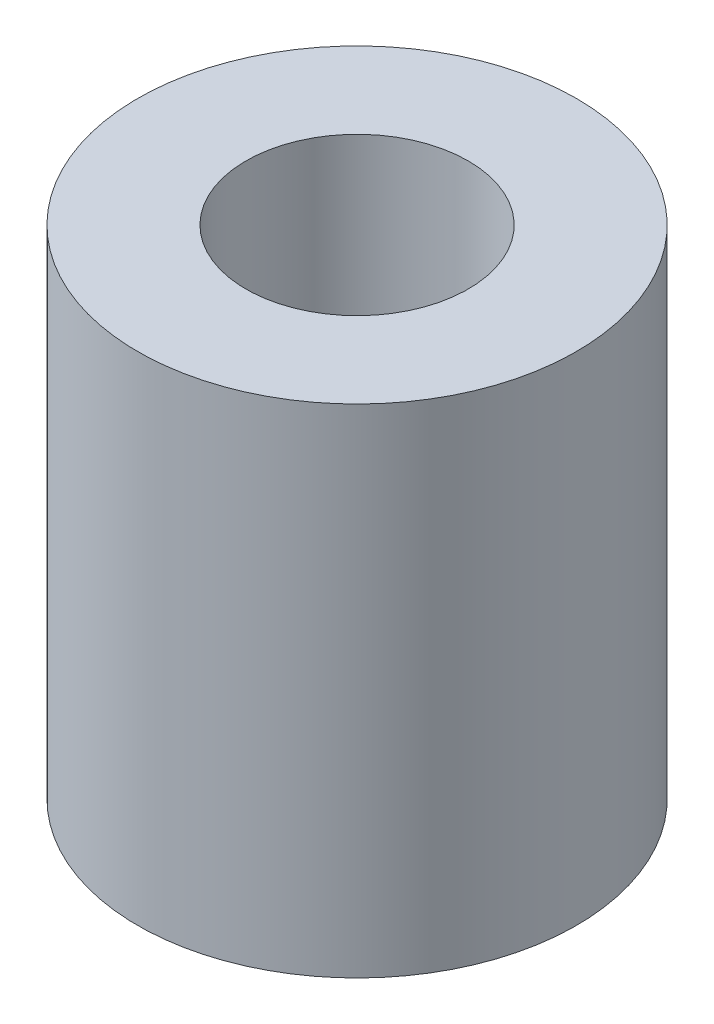
ISO-10303-21;
HEADER;
FILE_DESCRIPTION(('STEP AP214'),'2;1');
FILE_NAME('part.step','',(''),(''),'','','');
FILE_SCHEMA(('AUTOMOTIVE_DESIGN { 1 0 10303 214 1 1 1 1 }'));
ENDSEC;
DATA;
#1=APPLICATION_CONTEXT('core data for automotive mechanical design processes');
#2=APPLICATION_PROTOCOL_DEFINITION('international standard','automotive_design',2000,#1);
#3=PRODUCT_CONTEXT('',#1,'mechanical');
#4=PRODUCT('Part','Part','',(#3));
#5=PRODUCT_RELATED_PRODUCT_CATEGORY('part','',(#4));
#6=PRODUCT_DEFINITION_FORMATION('','',#4);
#7=PRODUCT_DEFINITION_CONTEXT('part definition',#1,'design');
#8=PRODUCT_DEFINITION('design','',#6,#7);
#9=PRODUCT_DEFINITION_SHAPE('','',#8);
#10=(LENGTH_UNIT() NAMED_UNIT(*) SI_UNIT(.MILLI.,.METRE.));
#11=(NAMED_UNIT(*) PLANE_ANGLE_UNIT() SI_UNIT($,.RADIAN.));
#12=(NAMED_UNIT(*) SI_UNIT($,.STERADIAN.) SOLID_ANGLE_UNIT());
#13=UNCERTAINTY_MEASURE_WITH_UNIT(LENGTH_MEASURE(1.E-05),#10,'distance_accuracy_value','');
#14=(GEOMETRIC_REPRESENTATION_CONTEXT(3) GLOBAL_UNCERTAINTY_ASSIGNED_CONTEXT((#13)) GLOBAL_UNIT_ASSIGNED_CONTEXT((#10,
#11,#12)) REPRESENTATION_CONTEXT('',''));
#15=CARTESIAN_POINT('',(0.,0.,0.));
#16=DIRECTION('',(0.,0.,1.));
#17=DIRECTION('',(1.,0.,0.));
#18=AXIS2_PLACEMENT_3D('',#15,#16,#17);
#19=CARTESIAN_POINT('',(0.,21.59,0.));
#20=DIRECTION('',(0.,-1.,0.));
#21=DIRECTION('',(0.,0.,-1.));
#22=AXIS2_PLACEMENT_3D('',#19,#20,#21);
#23=CYLINDRICAL_SURFACE('',#22,4.826);
#24=CARTESIAN_POINT('',(0.,0.,0.));
#25=DIRECTION('',(0.,-1.,0.));
#26=DIRECTION('',(0.,0.,-1.));
#27=AXIS2_PLACEMENT_3D('',#24,#25,#26);
#28=CIRCLE('',#27,4.826);
#29=CARTESIAN_POINT('',(0.,0.,-4.826));
#30=VERTEX_POINT('',#29);
#31=EDGE_CURVE('E18',#30,#30,#28,.T.);
#32=ORIENTED_EDGE('',*,*,#31,.T.);
#33=EDGE_LOOP('',(#32));
#34=FACE_BOUND('',#33,.T.);
#35=CARTESIAN_POINT('',(0.,21.59,0.));
#36=DIRECTION('',(0.,-1.,0.));
#37=DIRECTION('',(0.,0.,-1.));
#38=AXIS2_PLACEMENT_3D('',#35,#36,#37);
#39=CIRCLE('',#38,4.826);
#40=CARTESIAN_POINT('',(0.,21.59,-4.826));
#41=VERTEX_POINT('',#40);
#42=EDGE_CURVE('E27',#41,#41,#39,.T.);
#43=ORIENTED_EDGE('',*,*,#42,.F.);
#44=EDGE_LOOP('',(#43));
#45=FACE_BOUND('',#44,.T.);
#46=ADVANCED_FACE('F15',(#34,#45),#23,.F.);
#47=CARTESIAN_POINT('',(0.,0.,0.));
#48=DIRECTION('',(0.,1.,0.));
#49=DIRECTION('',(0.,0.,1.));
#50=AXIS2_PLACEMENT_3D('',#47,#48,#49);
#51=PLANE('',#50);
#52=ORIENTED_EDGE('',*,*,#31,.F.);
#53=EDGE_LOOP('',(#52));
#54=FACE_BOUND('',#53,.T.);
#55=CARTESIAN_POINT('',(0.,0.,0.));
#56=DIRECTION('',(0.,-1.,0.));
#57=DIRECTION('',(0.,0.,-1.));
#58=AXIS2_PLACEMENT_3D('',#55,#56,#57);
#59=CIRCLE('',#58,9.525);
#60=CARTESIAN_POINT('',(0.,0.,-9.525));
#61=VERTEX_POINT('',#60);
#62=EDGE_CURVE('E22',#61,#61,#59,.F.);
#63=ORIENTED_EDGE('',*,*,#62,.F.);
#64=EDGE_LOOP('',(#63));
#65=FACE_BOUND('',#64,.T.);
#66=ADVANCED_FACE('F37',(#54,#65),#51,.F.);
#67=CARTESIAN_POINT('',(0.,21.59,0.));
#68=DIRECTION('',(0.,1.,0.));
#69=DIRECTION('',(0.,0.,1.));
#70=AXIS2_PLACEMENT_3D('',#67,#68,#69);
#71=PLANE('',#70);
#72=ORIENTED_EDGE('',*,*,#42,.T.);
#73=EDGE_LOOP('',(#72));
#74=FACE_BOUND('',#73,.T.);
#75=CARTESIAN_POINT('',(0.,21.59,0.));
#76=DIRECTION('',(0.,-1.,0.));
#77=DIRECTION('',(0.,0.,-1.));
#78=AXIS2_PLACEMENT_3D('',#75,#76,#77);
#79=CIRCLE('',#78,9.525);
#80=CARTESIAN_POINT('',(0.,21.59,-9.525));
#81=VERTEX_POINT('',#80);
#82=EDGE_CURVE('E10',#81,#81,#79,.T.);
#83=ORIENTED_EDGE('',*,*,#82,.F.);
#84=EDGE_LOOP('',(#83));
#85=FACE_BOUND('',#84,.T.);
#86=ADVANCED_FACE('F40',(#74,#85),#71,.T.);
#87=CARTESIAN_POINT('',(0.,21.59,0.));
#88=DIRECTION('',(0.,-1.,0.));
#89=DIRECTION('',(0.,0.,-1.));
#90=AXIS2_PLACEMENT_3D('',#87,#88,#89);
#91=CYLINDRICAL_SURFACE('',#90,9.525);
#92=ORIENTED_EDGE('',*,*,#62,.T.);
#93=EDGE_LOOP('',(#92));
#94=FACE_BOUND('',#93,.T.);
#95=ORIENTED_EDGE('',*,*,#82,.T.);
#96=EDGE_LOOP('',(#95));
#97=FACE_BOUND('',#96,.T.);
#98=ADVANCED_FACE('F43',(#94,#97),#91,.T.);
#99=CLOSED_SHELL('',(#46,#66,#86,#98));
#100=MANIFOLD_SOLID_BREP('B1',#99);
#101=ADVANCED_BREP_SHAPE_REPRESENTATION('',(#18,#100),#14);
#102=SHAPE_DEFINITION_REPRESENTATION(#9,#101);
ENDSEC;
END-ISO-10303-21;
